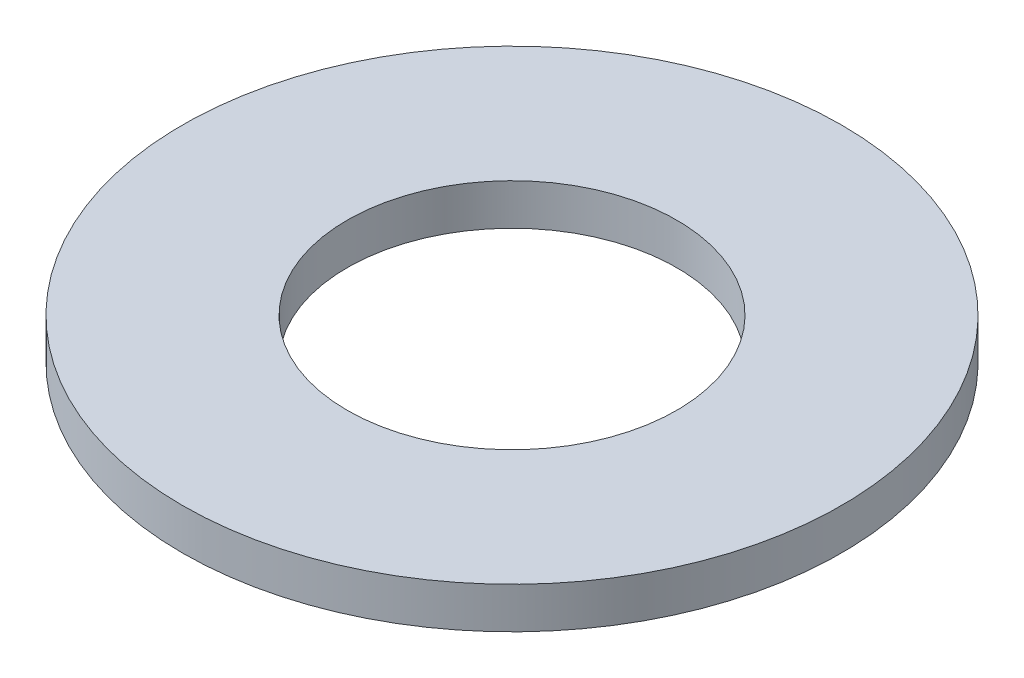
ISO-10303-21;
HEADER;
FILE_DESCRIPTION(('STEP AP214'),'2;1');
FILE_NAME('part.step','',(''),(''),'','','');
FILE_SCHEMA(('AUTOMOTIVE_DESIGN { 1 0 10303 214 1 1 1 1 }'));
ENDSEC;
DATA;
#1=APPLICATION_CONTEXT('core data for automotive mechanical design processes');
#2=APPLICATION_PROTOCOL_DEFINITION('international standard','automotive_design',2000,#1);
#3=PRODUCT_CONTEXT('',#1,'mechanical');
#4=PRODUCT('Part','Part','',(#3));
#5=PRODUCT_RELATED_PRODUCT_CATEGORY('part','',(#4));
#6=PRODUCT_DEFINITION_FORMATION('','',#4);
#7=PRODUCT_DEFINITION_CONTEXT('part definition',#1,'design');
#8=PRODUCT_DEFINITION('design','',#6,#7);
#9=PRODUCT_DEFINITION_SHAPE('','',#8);
#10=(LENGTH_UNIT() NAMED_UNIT(*) SI_UNIT(.MILLI.,.METRE.));
#11=(NAMED_UNIT(*) PLANE_ANGLE_UNIT() SI_UNIT($,.RADIAN.));
#12=(NAMED_UNIT(*) SI_UNIT($,.STERADIAN.) SOLID_ANGLE_UNIT());
#13=UNCERTAINTY_MEASURE_WITH_UNIT(LENGTH_MEASURE(1.E-05),#10,'distance_accuracy_value','');
#14=(GEOMETRIC_REPRESENTATION_CONTEXT(3) GLOBAL_UNCERTAINTY_ASSIGNED_CONTEXT((#13)) GLOBAL_UNIT_ASSIGNED_CONTEXT((#10,
#11,#12)) REPRESENTATION_CONTEXT('',''));
#15=CARTESIAN_POINT('',(0.,0.,0.));
#16=DIRECTION('',(0.,0.,1.));
#17=DIRECTION('',(1.,0.,0.));
#18=AXIS2_PLACEMENT_3D('',#15,#16,#17);
#19=CARTESIAN_POINT('',(0.,0.5,0.));
#20=DIRECTION('',(0.,1.,0.));
#21=DIRECTION('',(0.,0.,1.));
#22=AXIS2_PLACEMENT_3D('',#19,#20,#21);
#23=PLANE('',#22);
#24=CARTESIAN_POINT('',(0.,0.5,0.));
#25=DIRECTION('',(0.,1.,0.));
#26=DIRECTION('',(0.,0.,1.));
#27=AXIS2_PLACEMENT_3D('',#24,#25,#26);
#28=CIRCLE('',#27,4.);
#29=CARTESIAN_POINT('',(0.,0.5,4.));
#30=VERTEX_POINT('',#29);
#31=EDGE_CURVE('E10',#30,#30,#28,.T.);
#32=ORIENTED_EDGE('',*,*,#31,.T.);
#33=EDGE_LOOP('',(#32));
#34=FACE_BOUND('',#33,.T.);
#35=CARTESIAN_POINT('',(0.,0.5,0.));
#36=DIRECTION('',(0.,1.,0.));
#37=DIRECTION('',(0.,0.,1.));
#38=AXIS2_PLACEMENT_3D('',#35,#36,#37);
#39=CIRCLE('',#38,2.);
#40=CARTESIAN_POINT('',(0.,0.5,2.));
#41=VERTEX_POINT('',#40);
#42=EDGE_CURVE('E43',#41,#41,#39,.T.);
#43=ORIENTED_EDGE('',*,*,#42,.F.);
#44=EDGE_LOOP('',(#43));
#45=FACE_BOUND('',#44,.T.);
#46=ADVANCED_FACE('F32',(#34,#45),#23,.T.);
#47=CARTESIAN_POINT('',(0.,0.,0.));
#48=DIRECTION('',(0.,1.,0.));
#49=DIRECTION('',(0.,0.,1.));
#50=AXIS2_PLACEMENT_3D('',#47,#48,#49);
#51=PLANE('',#50);
#52=CARTESIAN_POINT('',(0.,0.,0.));
#53=DIRECTION('',(0.,1.,0.));
#54=DIRECTION('',(0.,0.,1.));
#55=AXIS2_PLACEMENT_3D('',#52,#53,#54);
#56=CIRCLE('',#55,4.);
#57=CARTESIAN_POINT('',(0.,0.,4.));
#58=VERTEX_POINT('',#57);
#59=EDGE_CURVE('E36',#58,#58,#56,.T.);
#60=ORIENTED_EDGE('',*,*,#59,.F.);
#61=EDGE_LOOP('',(#60));
#62=FACE_BOUND('',#61,.T.);
#63=CARTESIAN_POINT('',(0.,0.,0.));
#64=DIRECTION('',(0.,1.,0.));
#65=DIRECTION('',(0.,0.,1.));
#66=AXIS2_PLACEMENT_3D('',#63,#64,#65);
#67=CIRCLE('',#66,2.);
#68=CARTESIAN_POINT('',(0.,0.,2.));
#69=VERTEX_POINT('',#68);
#70=EDGE_CURVE('E45',#69,#69,#67,.T.);
#71=ORIENTED_EDGE('',*,*,#70,.T.);
#72=EDGE_LOOP('',(#71));
#73=FACE_BOUND('',#72,.T.);
#74=ADVANCED_FACE('F55',(#62,#73),#51,.F.);
#75=CARTESIAN_POINT('',(0.,0.5,0.));
#76=DIRECTION('',(0.,-1.,0.));
#77=DIRECTION('',(0.,0.,-1.));
#78=AXIS2_PLACEMENT_3D('',#75,#76,#77);
#79=CYLINDRICAL_SURFACE('',#78,4.);
#80=ORIENTED_EDGE('',*,*,#31,.F.);
#81=EDGE_LOOP('',(#80));
#82=FACE_BOUND('',#81,.T.);
#83=ORIENTED_EDGE('',*,*,#59,.T.);
#84=EDGE_LOOP('',(#83));
#85=FACE_BOUND('',#84,.T.);
#86=ADVANCED_FACE('F34',(#82,#85),#79,.T.);
#87=CARTESIAN_POINT('',(0.,0.5,0.));
#88=DIRECTION('',(0.,-1.,0.));
#89=DIRECTION('',(0.,0.,-1.));
#90=AXIS2_PLACEMENT_3D('',#87,#88,#89);
#91=CYLINDRICAL_SURFACE('',#90,2.);
#92=ORIENTED_EDGE('',*,*,#42,.T.);
#93=EDGE_LOOP('',(#92));
#94=FACE_BOUND('',#93,.T.);
#95=ORIENTED_EDGE('',*,*,#70,.F.);
#96=EDGE_LOOP('',(#95));
#97=FACE_BOUND('',#96,.T.);
#98=ADVANCED_FACE('F51',(#94,#97),#91,.F.);
#99=CLOSED_SHELL('',(#46,#74,#86,#98));
#100=MANIFOLD_SOLID_BREP('B2',#99);
#101=ADVANCED_BREP_SHAPE_REPRESENTATION('',(#18,#100),#14);
#102=SHAPE_DEFINITION_REPRESENTATION(#9,#101);
ENDSEC;
END-ISO-10303-21;
